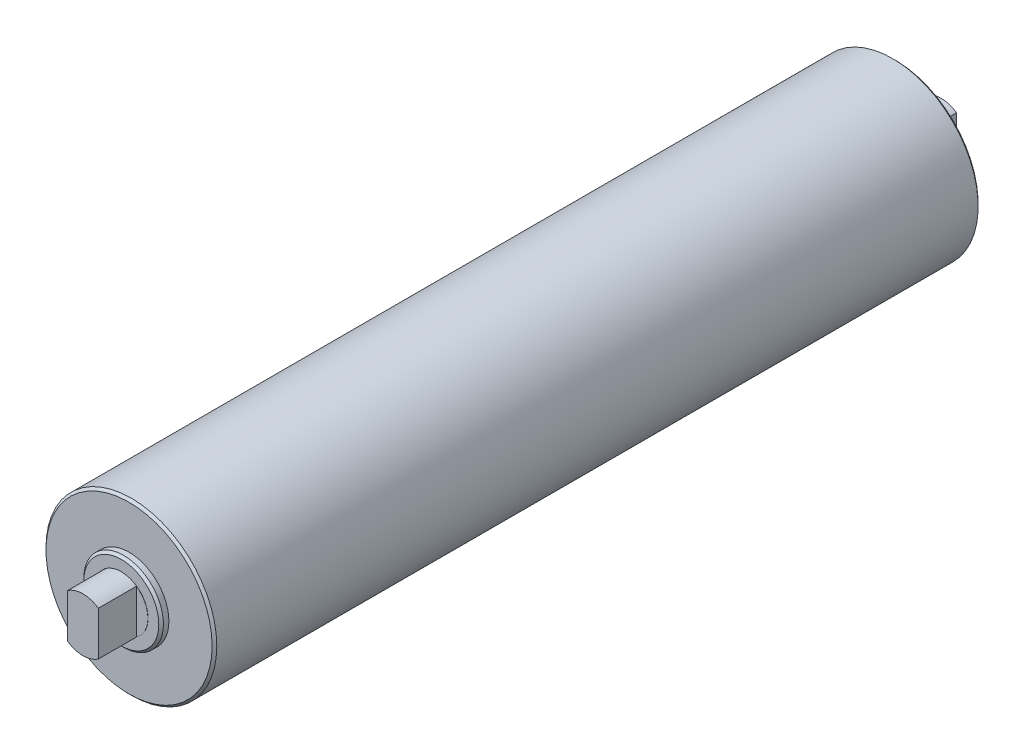
ISO-10303-21;
HEADER;
FILE_DESCRIPTION(('STEP AP214'),'2;1');
FILE_NAME('part.step','',(''),(''),'','','');
FILE_SCHEMA(('AUTOMOTIVE_DESIGN { 1 0 10303 214 1 1 1 1 }'));
ENDSEC;
DATA;
#1=APPLICATION_CONTEXT('core data for automotive mechanical design processes');
#2=APPLICATION_PROTOCOL_DEFINITION('international standard','automotive_design',2000,#1);
#3=PRODUCT_CONTEXT('',#1,'mechanical');
#4=PRODUCT('Part','Part','',(#3));
#5=PRODUCT_RELATED_PRODUCT_CATEGORY('part','',(#4));
#6=PRODUCT_DEFINITION_FORMATION('','',#4);
#7=PRODUCT_DEFINITION_CONTEXT('part definition',#1,'design');
#8=PRODUCT_DEFINITION('design','',#6,#7);
#9=PRODUCT_DEFINITION_SHAPE('','',#8);
#10=(LENGTH_UNIT() NAMED_UNIT(*) SI_UNIT(.MILLI.,.METRE.));
#11=(NAMED_UNIT(*) PLANE_ANGLE_UNIT() SI_UNIT($,.RADIAN.));
#12=(NAMED_UNIT(*) SI_UNIT($,.STERADIAN.) SOLID_ANGLE_UNIT());
#13=UNCERTAINTY_MEASURE_WITH_UNIT(LENGTH_MEASURE(1.E-05),#10,'distance_accuracy_value','');
#14=(GEOMETRIC_REPRESENTATION_CONTEXT(3) GLOBAL_UNCERTAINTY_ASSIGNED_CONTEXT((#13)) GLOBAL_UNIT_ASSIGNED_CONTEXT((#10,
#11,#12)) REPRESENTATION_CONTEXT('',''));
#15=CARTESIAN_POINT('',(0.,0.,0.));
#16=DIRECTION('',(0.,0.,1.));
#17=DIRECTION('',(1.,0.,0.));
#18=AXIS2_PLACEMENT_3D('',#15,#16,#17);
#19=CARTESIAN_POINT('',(0.,0.,-280.162));
#20=DIRECTION('',(0.,0.,1.));
#21=DIRECTION('',(1.,0.,0.));
#22=AXIS2_PLACEMENT_3D('',#19,#20,#21);
#23=CYLINDRICAL_SURFACE('',#22,17.5);
#24=CARTESIAN_POINT('',(0.,0.,-255.143));
#25=DIRECTION('',(0.,0.,-1.));
#26=DIRECTION('',(-1.,0.,0.));
#27=AXIS2_PLACEMENT_3D('',#24,#25,#26);
#28=CIRCLE('',#27,17.5);
#29=CARTESIAN_POINT('',(-17.5,0.,-255.143));
#30=VERTEX_POINT('',#29);
#31=EDGE_CURVE('E229',#30,#30,#28,.T.);
#32=ORIENTED_EDGE('',*,*,#31,.T.);
#33=EDGE_LOOP('',(#32));
#34=FACE_BOUND('',#33,.T.);
#35=CARTESIAN_POINT('',(0.,0.,-255.27));
#36=DIRECTION('',(0.,0.,-1.));
#37=DIRECTION('',(-1.,0.,0.));
#38=AXIS2_PLACEMENT_3D('',#35,#36,#37);
#39=CIRCLE('',#38,17.5);
#40=CARTESIAN_POINT('',(10.033,-14.338371978715,-255.27));
#41=VERTEX_POINT('',#40);
#42=CARTESIAN_POINT('',(10.033,14.338371978715,-255.27));
#43=VERTEX_POINT('',#42);
#44=EDGE_CURVE('E122',#41,#43,#39,.F.);
#45=ORIENTED_EDGE('',*,*,#44,.T.);
#46=DIRECTION('',(0.,0.,-1.));
#47=VECTOR('',#46,1.);
#48=CARTESIAN_POINT('',(10.033,14.338371978715,-255.27));
#49=LINE('',#48,#47);
#50=CARTESIAN_POINT('',(10.033,14.338371978715,-280.162));
#51=VERTEX_POINT('',#50);
#52=EDGE_CURVE('E131',#43,#51,#49,.T.);
#53=ORIENTED_EDGE('',*,*,#52,.T.);
#54=CARTESIAN_POINT('',(0.,0.,-280.162));
#55=DIRECTION('',(0.,0.,1.));
#56=DIRECTION('',(1.,0.,0.));
#57=AXIS2_PLACEMENT_3D('',#54,#55,#56);
#58=CIRCLE('',#57,17.5);
#59=CARTESIAN_POINT('',(-10.033,14.338371978715,-280.162));
#60=VERTEX_POINT('',#59);
#61=EDGE_CURVE('E68',#51,#60,#58,.T.);
#62=ORIENTED_EDGE('',*,*,#61,.T.);
#63=DIRECTION('',(0.,0.,-1.));
#64=VECTOR('',#63,1.);
#65=CARTESIAN_POINT('',(-10.033,14.338371978715,-255.27));
#66=LINE('',#65,#64);
#67=CARTESIAN_POINT('',(-10.033,14.338371978715,-255.27));
#68=VERTEX_POINT('',#67);
#69=EDGE_CURVE('E151',#68,#60,#66,.T.);
#70=ORIENTED_EDGE('',*,*,#69,.F.);
#71=CARTESIAN_POINT('',(0.,0.,-255.27));
#72=DIRECTION('',(0.,0.,-1.));
#73=DIRECTION('',(-1.,0.,0.));
#74=AXIS2_PLACEMENT_3D('',#71,#72,#73);
#75=CIRCLE('',#74,17.5);
#76=CARTESIAN_POINT('',(-10.033,-14.338371978715,-255.27));
#77=VERTEX_POINT('',#76);
#78=EDGE_CURVE('E128',#68,#77,#75,.F.);
#79=ORIENTED_EDGE('',*,*,#78,.T.);
#80=DIRECTION('',(0.,0.,-1.));
#81=VECTOR('',#80,1.);
#82=CARTESIAN_POINT('',(-10.033,-14.338371978715,-255.27));
#83=LINE('',#82,#81);
#84=CARTESIAN_POINT('',(-10.033,-14.338371978715,-280.162));
#85=VERTEX_POINT('',#84);
#86=EDGE_CURVE('E155',#77,#85,#83,.T.);
#87=ORIENTED_EDGE('',*,*,#86,.T.);
#88=CARTESIAN_POINT('',(10.033,-14.338371978715,-280.162));
#89=VERTEX_POINT('',#88);
#90=EDGE_CURVE('E138',#85,#89,#58,.T.);
#91=ORIENTED_EDGE('',*,*,#90,.T.);
#92=DIRECTION('',(0.,0.,-1.));
#93=VECTOR('',#92,1.);
#94=CARTESIAN_POINT('',(10.033,-14.338371978715,-255.27));
#95=LINE('',#94,#93);
#96=EDGE_CURVE('E57',#41,#89,#95,.T.);
#97=ORIENTED_EDGE('',*,*,#96,.F.);
#98=EDGE_LOOP('',(#45,#53,#62,#70,#79,#87,#91,#97));
#99=FACE_BOUND('',#98,.T.);
#100=ADVANCED_FACE('F38',(#34,#99),#23,.T.);
#101=CARTESIAN_POINT('',(0.,0.,-280.162));
#102=DIRECTION('',(0.,0.,-1.));
#103=DIRECTION('',(1.,0.,0.));
#104=AXIS2_PLACEMENT_3D('',#101,#102,#103);
#105=PLANE('',#104);
#106=ORIENTED_EDGE('',*,*,#61,.F.);
#107=DIRECTION('',(0.,-1.,0.));
#108=VECTOR('',#107,1.);
#109=CARTESIAN_POINT('',(10.033,14.338371978715,-280.162));
#110=LINE('',#109,#108);
#111=EDGE_CURVE('E133',#51,#89,#110,.T.);
#112=ORIENTED_EDGE('',*,*,#111,.T.);
#113=ORIENTED_EDGE('',*,*,#90,.F.);
#114=DIRECTION('',(0.,1.,0.));
#115=VECTOR('',#114,1.);
#116=CARTESIAN_POINT('',(-10.033,14.338371978715,-280.162));
#117=LINE('',#116,#115);
#118=EDGE_CURVE('E143',#85,#60,#117,.T.);
#119=ORIENTED_EDGE('',*,*,#118,.T.);
#120=EDGE_LOOP('',(#106,#112,#113,#119));
#121=FACE_BOUND('',#120,.T.);
#122=ADVANCED_FACE('F257',(#121),#105,.T.);
#123=CARTESIAN_POINT('',(0.,0.,255.143));
#124=DIRECTION('',(0.,0.,1.));
#125=DIRECTION('',(1.,0.,0.));
#126=AXIS2_PLACEMENT_3D('',#123,#124,#125);
#127=PLANE('',#126);
#128=CARTESIAN_POINT('',(0.,0.,255.143));
#129=DIRECTION('',(0.,0.,1.));
#130=DIRECTION('',(1.,0.,0.));
#131=AXIS2_PLACEMENT_3D('',#128,#129,#130);
#132=CIRCLE('',#131,24.476);
#133=CARTESIAN_POINT('',(24.476,0.,255.143));
#134=VERTEX_POINT('',#133);
#135=EDGE_CURVE('E209',#134,#134,#132,.T.);
#136=ORIENTED_EDGE('',*,*,#135,.T.);
#137=EDGE_LOOP('',(#136));
#138=FACE_BOUND('',#137,.T.);
#139=CARTESIAN_POINT('',(0.,0.,255.143));
#140=DIRECTION('',(0.,0.,1.));
#141=DIRECTION('',(1.,0.,0.));
#142=AXIS2_PLACEMENT_3D('',#139,#140,#141);
#143=CIRCLE('',#142,17.5);
#144=CARTESIAN_POINT('',(17.5,0.,255.143));
#145=VERTEX_POINT('',#144);
#146=EDGE_CURVE('E188',#145,#145,#143,.T.);
#147=ORIENTED_EDGE('',*,*,#146,.F.);
#148=EDGE_LOOP('',(#147));
#149=FACE_BOUND('',#148,.T.);
#150=ADVANCED_FACE('F263',(#138,#149),#127,.T.);
#151=CARTESIAN_POINT('',(0.,0.,250.063));
#152=DIRECTION('',(0.,0.,1.));
#153=DIRECTION('',(1.,0.,0.));
#154=AXIS2_PLACEMENT_3D('',#151,#152,#153);
#155=PLANE('',#154);
#156=CARTESIAN_POINT('',(0.,0.,250.063));
#157=DIRECTION('',(0.,0.,1.));
#158=DIRECTION('',(1.,0.,0.));
#159=AXIS2_PLACEMENT_3D('',#156,#157,#158);
#160=CIRCLE('',#159,54.2290000000001);
#161=CARTESIAN_POINT('',(54.2290000000001,0.,250.063));
#162=VERTEX_POINT('',#161);
#163=EDGE_CURVE('E217',#162,#162,#160,.T.);
#164=ORIENTED_EDGE('',*,*,#163,.T.);
#165=EDGE_LOOP('',(#164));
#166=FACE_BOUND('',#165,.T.);
#167=CARTESIAN_POINT('',(0.,0.,250.063));
#168=DIRECTION('',(0.,0.,1.));
#169=DIRECTION('',(1.,0.,0.));
#170=AXIS2_PLACEMENT_3D('',#167,#168,#169);
#171=CIRCLE('',#170,26.);
#172=CARTESIAN_POINT('',(26.,0.,250.063));
#173=VERTEX_POINT('',#172);
#174=EDGE_CURVE('E195',#173,#173,#171,.T.);
#175=ORIENTED_EDGE('',*,*,#174,.F.);
#176=EDGE_LOOP('',(#175));
#177=FACE_BOUND('',#176,.T.);
#178=ADVANCED_FACE('F310',(#166,#177),#155,.T.);
#179=CARTESIAN_POINT('',(0.,0.,250.063));
#180=DIRECTION('',(0.,0.,-1.));
#181=DIRECTION('',(-1.,0.,0.));
#182=AXIS2_PLACEMENT_3D('',#179,#180,#181);
#183=CYLINDRICAL_SURFACE('',#182,55.753);
#184=CARTESIAN_POINT('',(0.,0.,-248.539));
#185=DIRECTION('',(0.,0.,-1.));
#186=DIRECTION('',(-1.,0.,0.));
#187=AXIS2_PLACEMENT_3D('',#184,#185,#186);
#188=CIRCLE('',#187,55.753);
#189=CARTESIAN_POINT('',(-55.753,0.,-248.539));
#190=VERTEX_POINT('',#189);
#191=EDGE_CURVE('E47',#190,#190,#188,.F.);
#192=ORIENTED_EDGE('',*,*,#191,.T.);
#193=EDGE_LOOP('',(#192));
#194=FACE_BOUND('',#193,.T.);
#195=CARTESIAN_POINT('',(0.,0.,248.539));
#196=DIRECTION('',(0.,0.,1.));
#197=DIRECTION('',(1.,0.,0.));
#198=AXIS2_PLACEMENT_3D('',#195,#196,#197);
#199=CIRCLE('',#198,55.753);
#200=CARTESIAN_POINT('',(55.753,0.,248.539));
#201=VERTEX_POINT('',#200);
#202=EDGE_CURVE('E221',#201,#201,#199,.F.);
#203=ORIENTED_EDGE('',*,*,#202,.T.);
#204=EDGE_LOOP('',(#203));
#205=FACE_BOUND('',#204,.T.);
#206=ADVANCED_FACE('F245',(#194,#205),#183,.T.);
#207=CARTESIAN_POINT('',(0.,0.,255.143));
#208=DIRECTION('',(0.,0.,-1.));
#209=DIRECTION('',(-1.,0.,0.));
#210=AXIS2_PLACEMENT_3D('',#207,#208,#209);
#211=CYLINDRICAL_SURFACE('',#210,26.);
#212=CARTESIAN_POINT('',(0.,0.,253.619));
#213=DIRECTION('',(0.,0.,1.));
#214=DIRECTION('',(1.,0.,0.));
#215=AXIS2_PLACEMENT_3D('',#212,#213,#214);
#216=CIRCLE('',#215,26.);
#217=CARTESIAN_POINT('',(26.,0.,253.619));
#218=VERTEX_POINT('',#217);
#219=EDGE_CURVE('E213',#218,#218,#216,.F.);
#220=ORIENTED_EDGE('',*,*,#219,.T.);
#221=EDGE_LOOP('',(#220));
#222=FACE_BOUND('',#221,.T.);
#223=ORIENTED_EDGE('',*,*,#174,.T.);
#224=EDGE_LOOP('',(#223));
#225=FACE_BOUND('',#224,.T.);
#226=ADVANCED_FACE('F306',(#222,#225),#211,.T.);
#227=CARTESIAN_POINT('',(0.,0.,280.162));
#228=DIRECTION('',(0.,0.,-1.));
#229=DIRECTION('',(-1.,0.,0.));
#230=AXIS2_PLACEMENT_3D('',#227,#228,#229);
#231=CYLINDRICAL_SURFACE('',#230,17.5);
#232=CARTESIAN_POINT('',(0.,0.,280.162));
#233=DIRECTION('',(0.,0.,1.));
#234=DIRECTION('',(1.,0.,0.));
#235=AXIS2_PLACEMENT_3D('',#232,#233,#234);
#236=CIRCLE('',#235,17.5);
#237=CARTESIAN_POINT('',(10.033,14.338371978715,280.162));
#238=VERTEX_POINT('',#237);
#239=CARTESIAN_POINT('',(-10.033,14.338371978715,280.162));
#240=VERTEX_POINT('',#239);
#241=EDGE_CURVE('E196',#238,#240,#236,.T.);
#242=ORIENTED_EDGE('',*,*,#241,.F.);
#243=DIRECTION('',(0.,0.,1.));
#244=VECTOR('',#243,1.);
#245=CARTESIAN_POINT('',(10.033,14.338371978715,255.27));
#246=LINE('',#245,#244);
#247=CARTESIAN_POINT('',(10.033,14.338371978715,255.27));
#248=VERTEX_POINT('',#247);
#249=EDGE_CURVE('E166',#248,#238,#246,.T.);
#250=ORIENTED_EDGE('',*,*,#249,.F.);
#251=CARTESIAN_POINT('',(0.,0.,255.27));
#252=DIRECTION('',(0.,0.,1.));
#253=DIRECTION('',(1.,0.,0.));
#254=AXIS2_PLACEMENT_3D('',#251,#252,#253);
#255=CIRCLE('',#254,17.5);
#256=CARTESIAN_POINT('',(10.033,-14.338371978715,255.27));
#257=VERTEX_POINT('',#256);
#258=EDGE_CURVE('E206',#257,#248,#255,.T.);
#259=ORIENTED_EDGE('',*,*,#258,.F.);
#260=DIRECTION('',(0.,0.,1.));
#261=VECTOR('',#260,1.);
#262=CARTESIAN_POINT('',(10.033,-14.338371978715,255.27));
#263=LINE('',#262,#261);
#264=CARTESIAN_POINT('',(10.033,-14.338371978715,280.162));
#265=VERTEX_POINT('',#264);
#266=EDGE_CURVE('E169',#257,#265,#263,.T.);
#267=ORIENTED_EDGE('',*,*,#266,.T.);
#268=CARTESIAN_POINT('',(-10.033,-14.338371978715,280.162));
#269=VERTEX_POINT('',#268);
#270=EDGE_CURVE('E191',#269,#265,#236,.T.);
#271=ORIENTED_EDGE('',*,*,#270,.F.);
#272=DIRECTION('',(0.,0.,1.));
#273=VECTOR('',#272,1.);
#274=CARTESIAN_POINT('',(-10.033,-14.338371978715,255.27));
#275=LINE('',#274,#273);
#276=CARTESIAN_POINT('',(-10.033,-14.338371978715,255.27));
#277=VERTEX_POINT('',#276);
#278=EDGE_CURVE('E180',#277,#269,#275,.T.);
#279=ORIENTED_EDGE('',*,*,#278,.F.);
#280=CARTESIAN_POINT('',(0.,0.,255.27));
#281=DIRECTION('',(0.,0.,1.));
#282=DIRECTION('',(1.,0.,0.));
#283=AXIS2_PLACEMENT_3D('',#280,#281,#282);
#284=CIRCLE('',#283,17.5);
#285=CARTESIAN_POINT('',(-10.033,14.338371978715,255.27));
#286=VERTEX_POINT('',#285);
#287=EDGE_CURVE('E203',#286,#277,#284,.T.);
#288=ORIENTED_EDGE('',*,*,#287,.F.);
#289=DIRECTION('',(0.,0.,1.));
#290=VECTOR('',#289,1.);
#291=CARTESIAN_POINT('',(-10.033,14.338371978715,255.27));
#292=LINE('',#291,#290);
#293=EDGE_CURVE('E184',#286,#240,#292,.T.);
#294=ORIENTED_EDGE('',*,*,#293,.T.);
#295=EDGE_LOOP('',(#242,#250,#259,#267,#271,#279,#288,#294));
#296=FACE_BOUND('',#295,.T.);
#297=ORIENTED_EDGE('',*,*,#146,.T.);
#298=EDGE_LOOP('',(#297));
#299=FACE_BOUND('',#298,.T.);
#300=ADVANCED_FACE('F302',(#296,#299),#231,.T.);
#301=CARTESIAN_POINT('',(0.,0.,280.162));
#302=DIRECTION('',(0.,0.,1.));
#303=DIRECTION('',(1.,0.,0.));
#304=AXIS2_PLACEMENT_3D('',#301,#302,#303);
#305=PLANE('',#304);
#306=DIRECTION('',(0.,-1.,0.));
#307=VECTOR('',#306,1.);
#308=CARTESIAN_POINT('',(10.033,14.338371978715,280.162));
#309=LINE('',#308,#307);
#310=EDGE_CURVE('E161',#238,#265,#309,.T.);
#311=ORIENTED_EDGE('',*,*,#310,.F.);
#312=ORIENTED_EDGE('',*,*,#241,.T.);
#313=DIRECTION('',(0.,1.,0.));
#314=VECTOR('',#313,1.);
#315=CARTESIAN_POINT('',(-10.033,14.338371978715,280.162));
#316=LINE('',#315,#314);
#317=EDGE_CURVE('E173',#269,#240,#316,.T.);
#318=ORIENTED_EDGE('',*,*,#317,.F.);
#319=ORIENTED_EDGE('',*,*,#270,.T.);
#320=EDGE_LOOP('',(#311,#312,#318,#319));
#321=FACE_BOUND('',#320,.T.);
#322=ADVANCED_FACE('F295',(#321),#305,.T.);
#323=CARTESIAN_POINT('',(-17.5,-14.338371978715,255.27));
#324=DIRECTION('',(0.,0.,1.));
#325=DIRECTION('',(1.,0.,0.));
#326=AXIS2_PLACEMENT_3D('',#323,#324,#325);
#327=PLANE('',#326);
#328=DIRECTION('',(0.,1.,0.));
#329=VECTOR('',#328,1.);
#330=CARTESIAN_POINT('',(-10.033,14.338371978715,255.27));
#331=LINE('',#330,#329);
#332=EDGE_CURVE('E176',#277,#286,#331,.T.);
#333=ORIENTED_EDGE('',*,*,#332,.T.);
#334=ORIENTED_EDGE('',*,*,#287,.T.);
#335=EDGE_LOOP('',(#333,#334));
#336=FACE_BOUND('',#335,.T.);
#337=ADVANCED_FACE('F292',(#336),#327,.T.);
#338=CARTESIAN_POINT('',(-10.033,14.338371978715,255.27));
#339=DIRECTION('',(1.,0.,0.));
#340=DIRECTION('',(0.,0.,-1.));
#341=AXIS2_PLACEMENT_3D('',#338,#339,#340);
#342=PLANE('',#341);
#343=ORIENTED_EDGE('',*,*,#317,.T.);
#344=ORIENTED_EDGE('',*,*,#293,.F.);
#345=ORIENTED_EDGE('',*,*,#332,.F.);
#346=ORIENTED_EDGE('',*,*,#278,.T.);
#347=EDGE_LOOP('',(#343,#344,#345,#346));
#348=FACE_BOUND('',#347,.T.);
#349=ADVANCED_FACE('F286',(#348),#342,.F.);
#350=CARTESIAN_POINT('',(10.033,14.338371978715,255.27));
#351=DIRECTION('',(0.,0.,1.));
#352=DIRECTION('',(1.,0.,0.));
#353=AXIS2_PLACEMENT_3D('',#350,#351,#352);
#354=PLANE('',#353);
#355=ORIENTED_EDGE('',*,*,#258,.T.);
#356=DIRECTION('',(0.,-1.,0.));
#357=VECTOR('',#356,1.);
#358=CARTESIAN_POINT('',(10.033,14.338371978715,255.27));
#359=LINE('',#358,#357);
#360=EDGE_CURVE('E162',#248,#257,#359,.T.);
#361=ORIENTED_EDGE('',*,*,#360,.T.);
#362=EDGE_LOOP('',(#355,#361));
#363=FACE_BOUND('',#362,.T.);
#364=ADVANCED_FACE('F282',(#363),#354,.T.);
#365=CARTESIAN_POINT('',(10.033,14.338371978715,255.27));
#366=DIRECTION('',(-1.,0.,0.));
#367=DIRECTION('',(0.,0.,1.));
#368=AXIS2_PLACEMENT_3D('',#365,#366,#367);
#369=PLANE('',#368);
#370=ORIENTED_EDGE('',*,*,#310,.T.);
#371=ORIENTED_EDGE('',*,*,#266,.F.);
#372=ORIENTED_EDGE('',*,*,#360,.F.);
#373=ORIENTED_EDGE('',*,*,#249,.T.);
#374=EDGE_LOOP('',(#370,#371,#372,#373));
#375=FACE_BOUND('',#374,.T.);
#376=ADVANCED_FACE('F285',(#375),#369,.F.);
#377=CARTESIAN_POINT('',(0.,0.,255.143));
#378=DIRECTION('',(0.,0.,-1.));
#379=DIRECTION('',(-1.,0.,0.));
#380=AXIS2_PLACEMENT_3D('',#377,#378,#379);
#381=CONICAL_SURFACE('',#380,24.476,0.78539816339746);
#382=ORIENTED_EDGE('',*,*,#219,.F.);
#383=EDGE_LOOP('',(#382));
#384=FACE_BOUND('',#383,.T.);
#385=ORIENTED_EDGE('',*,*,#135,.F.);
#386=EDGE_LOOP('',(#385));
#387=FACE_BOUND('',#386,.T.);
#388=ADVANCED_FACE('F290',(#384,#387),#381,.T.);
#389=CARTESIAN_POINT('',(0.,0.,250.063));
#390=DIRECTION('',(0.,0.,-1.));
#391=DIRECTION('',(-1.,0.,0.));
#392=AXIS2_PLACEMENT_3D('',#389,#390,#391);
#393=CONICAL_SURFACE('',#392,54.2290000000001,0.785398163397448);
#394=ORIENTED_EDGE('',*,*,#202,.F.);
#395=EDGE_LOOP('',(#394));
#396=FACE_BOUND('',#395,.T.);
#397=ORIENTED_EDGE('',*,*,#163,.F.);
#398=EDGE_LOOP('',(#397));
#399=FACE_BOUND('',#398,.T.);
#400=ADVANCED_FACE('F280',(#396,#399),#393,.T.);
#401=CARTESIAN_POINT('',(0.,0.,-250.063));
#402=DIRECTION('',(0.,0.,-1.));
#403=DIRECTION('',(1.,0.,0.));
#404=AXIS2_PLACEMENT_3D('',#401,#402,#403);
#405=PLANE('',#404);
#406=CARTESIAN_POINT('',(0.,0.,-250.063));
#407=DIRECTION('',(0.,0.,-1.));
#408=DIRECTION('',(-1.,0.,0.));
#409=AXIS2_PLACEMENT_3D('',#406,#407,#408);
#410=CIRCLE('',#409,54.229);
#411=CARTESIAN_POINT('',(-54.229,0.,-250.063));
#412=VERTEX_POINT('',#411);
#413=EDGE_CURVE('E11',#412,#412,#410,.T.);
#414=ORIENTED_EDGE('',*,*,#413,.T.);
#415=EDGE_LOOP('',(#414));
#416=FACE_BOUND('',#415,.T.);
#417=CARTESIAN_POINT('',(0.,0.,-250.063));
#418=DIRECTION('',(0.,0.,-1.));
#419=DIRECTION('',(-1.,0.,0.));
#420=AXIS2_PLACEMENT_3D('',#417,#418,#419);
#421=CIRCLE('',#420,26.);
#422=CARTESIAN_POINT('',(-26.,0.,-250.063));
#423=VERTEX_POINT('',#422);
#424=EDGE_CURVE('E225',#423,#423,#421,.T.);
#425=ORIENTED_EDGE('',*,*,#424,.F.);
#426=EDGE_LOOP('',(#425));
#427=FACE_BOUND('',#426,.T.);
#428=ADVANCED_FACE('F276',(#416,#427),#405,.T.);
#429=CARTESIAN_POINT('',(0.,0.,-255.143));
#430=DIRECTION('',(0.,0.,1.));
#431=DIRECTION('',(1.,0.,0.));
#432=AXIS2_PLACEMENT_3D('',#429,#430,#431);
#433=CYLINDRICAL_SURFACE('',#432,26.);
#434=CARTESIAN_POINT('',(0.,0.,-253.619));
#435=DIRECTION('',(0.,0.,-1.));
#436=DIRECTION('',(-1.,0.,0.));
#437=AXIS2_PLACEMENT_3D('',#434,#435,#436);
#438=CIRCLE('',#437,26.);
#439=CARTESIAN_POINT('',(-26.,0.,-253.619));
#440=VERTEX_POINT('',#439);
#441=EDGE_CURVE('E127',#440,#440,#438,.F.);
#442=ORIENTED_EDGE('',*,*,#441,.T.);
#443=EDGE_LOOP('',(#442));
#444=FACE_BOUND('',#443,.T.);
#445=ORIENTED_EDGE('',*,*,#424,.T.);
#446=EDGE_LOOP('',(#445));
#447=FACE_BOUND('',#446,.T.);
#448=ADVANCED_FACE('F272',(#444,#447),#433,.T.);
#449=CARTESIAN_POINT('',(0.,0.,-255.143));
#450=DIRECTION('',(0.,0.,-1.));
#451=DIRECTION('',(1.,0.,0.));
#452=AXIS2_PLACEMENT_3D('',#449,#450,#451);
#453=PLANE('',#452);
#454=CARTESIAN_POINT('',(0.,0.,-255.143));
#455=DIRECTION('',(0.,0.,-1.));
#456=DIRECTION('',(-1.,0.,0.));
#457=AXIS2_PLACEMENT_3D('',#454,#455,#456);
#458=CIRCLE('',#457,24.4759999999999);
#459=CARTESIAN_POINT('',(-24.4759999999999,0.,-255.143));
#460=VERTEX_POINT('',#459);
#461=EDGE_CURVE('E238',#460,#460,#458,.T.);
#462=ORIENTED_EDGE('',*,*,#461,.T.);
#463=EDGE_LOOP('',(#462));
#464=FACE_BOUND('',#463,.T.);
#465=ORIENTED_EDGE('',*,*,#31,.F.);
#466=EDGE_LOOP('',(#465));
#467=FACE_BOUND('',#466,.T.);
#468=ADVANCED_FACE('F268',(#464,#467),#453,.T.);
#469=CARTESIAN_POINT('',(-10.033,14.338371978715,-255.27));
#470=DIRECTION('',(-1.,0.,0.));
#471=DIRECTION('',(0.,0.,1.));
#472=AXIS2_PLACEMENT_3D('',#469,#470,#471);
#473=PLANE('',#472);
#474=ORIENTED_EDGE('',*,*,#118,.F.);
#475=ORIENTED_EDGE('',*,*,#86,.F.);
#476=DIRECTION('',(0.,1.,0.));
#477=VECTOR('',#476,1.);
#478=CARTESIAN_POINT('',(-10.033,14.338371978715,-255.27));
#479=LINE('',#478,#477);
#480=EDGE_CURVE('E147',#77,#68,#479,.T.);
#481=ORIENTED_EDGE('',*,*,#480,.T.);
#482=ORIENTED_EDGE('',*,*,#69,.T.);
#483=EDGE_LOOP('',(#474,#475,#481,#482));
#484=FACE_BOUND('',#483,.T.);
#485=ADVANCED_FACE('F271',(#484),#473,.T.);
#486=CARTESIAN_POINT('',(-17.5,-14.338371978715,-255.27));
#487=DIRECTION('',(0.,0.,-1.));
#488=DIRECTION('',(1.,0.,0.));
#489=AXIS2_PLACEMENT_3D('',#486,#487,#488);
#490=PLANE('',#489);
#491=ORIENTED_EDGE('',*,*,#78,.F.);
#492=ORIENTED_EDGE('',*,*,#480,.F.);
#493=EDGE_LOOP('',(#491,#492));
#494=FACE_BOUND('',#493,.T.);
#495=ADVANCED_FACE('F353',(#494),#490,.T.);
#496=CARTESIAN_POINT('',(10.033,14.338371978715,-255.27));
#497=DIRECTION('',(1.,0.,0.));
#498=DIRECTION('',(0.,0.,-1.));
#499=AXIS2_PLACEMENT_3D('',#496,#497,#498);
#500=PLANE('',#499);
#501=ORIENTED_EDGE('',*,*,#111,.F.);
#502=ORIENTED_EDGE('',*,*,#52,.F.);
#503=DIRECTION('',(0.,-1.,0.));
#504=VECTOR('',#503,1.);
#505=CARTESIAN_POINT('',(10.033,14.338371978715,-255.27));
#506=LINE('',#505,#504);
#507=EDGE_CURVE('E124',#43,#41,#506,.T.);
#508=ORIENTED_EDGE('',*,*,#507,.T.);
#509=ORIENTED_EDGE('',*,*,#96,.T.);
#510=EDGE_LOOP('',(#501,#502,#508,#509));
#511=FACE_BOUND('',#510,.T.);
#512=ADVANCED_FACE('F130',(#511),#500,.T.);
#513=CARTESIAN_POINT('',(10.033,14.338371978715,-255.27));
#514=DIRECTION('',(0.,0.,-1.));
#515=DIRECTION('',(1.,0.,0.));
#516=AXIS2_PLACEMENT_3D('',#513,#514,#515);
#517=PLANE('',#516);
#518=ORIENTED_EDGE('',*,*,#507,.F.);
#519=ORIENTED_EDGE('',*,*,#44,.F.);
#520=EDGE_LOOP('',(#518,#519));
#521=FACE_BOUND('',#520,.T.);
#522=ADVANCED_FACE('F123',(#521),#517,.T.);
#523=CARTESIAN_POINT('',(0.,0.,-253.619));
#524=DIRECTION('',(0.,0.,1.));
#525=DIRECTION('',(1.,0.,0.));
#526=AXIS2_PLACEMENT_3D('',#523,#524,#525);
#527=CONICAL_SURFACE('',#526,26.,0.78539816339746);
#528=ORIENTED_EDGE('',*,*,#461,.F.);
#529=EDGE_LOOP('',(#528));
#530=FACE_BOUND('',#529,.T.);
#531=ORIENTED_EDGE('',*,*,#441,.F.);
#532=EDGE_LOOP('',(#531));
#533=FACE_BOUND('',#532,.T.);
#534=ADVANCED_FACE('F249',(#530,#533),#527,.T.);
#535=CARTESIAN_POINT('',(0.,0.,-248.539));
#536=DIRECTION('',(0.,0.,1.));
#537=DIRECTION('',(1.,0.,0.));
#538=AXIS2_PLACEMENT_3D('',#535,#536,#537);
#539=CONICAL_SURFACE('',#538,55.753,0.785398163397448);
#540=ORIENTED_EDGE('',*,*,#413,.F.);
#541=EDGE_LOOP('',(#540));
#542=FACE_BOUND('',#541,.T.);
#543=ORIENTED_EDGE('',*,*,#191,.F.);
#544=EDGE_LOOP('',(#543));
#545=FACE_BOUND('',#544,.T.);
#546=ADVANCED_FACE('F40',(#542,#545),#539,.T.);
#547=CLOSED_SHELL('',(#100,#122,#150,#178,#206,#226,#300,#322,#337,#349,#364,#376,#388,#400,
#428,#448,#468,#485,#495,#512,#522,#534,#546));
#548=MANIFOLD_SOLID_BREP('B2',#547);
#549=ADVANCED_BREP_SHAPE_REPRESENTATION('',(#18,#548),#14);
#550=SHAPE_DEFINITION_REPRESENTATION(#9,#549);
ENDSEC;
END-ISO-10303-21;
